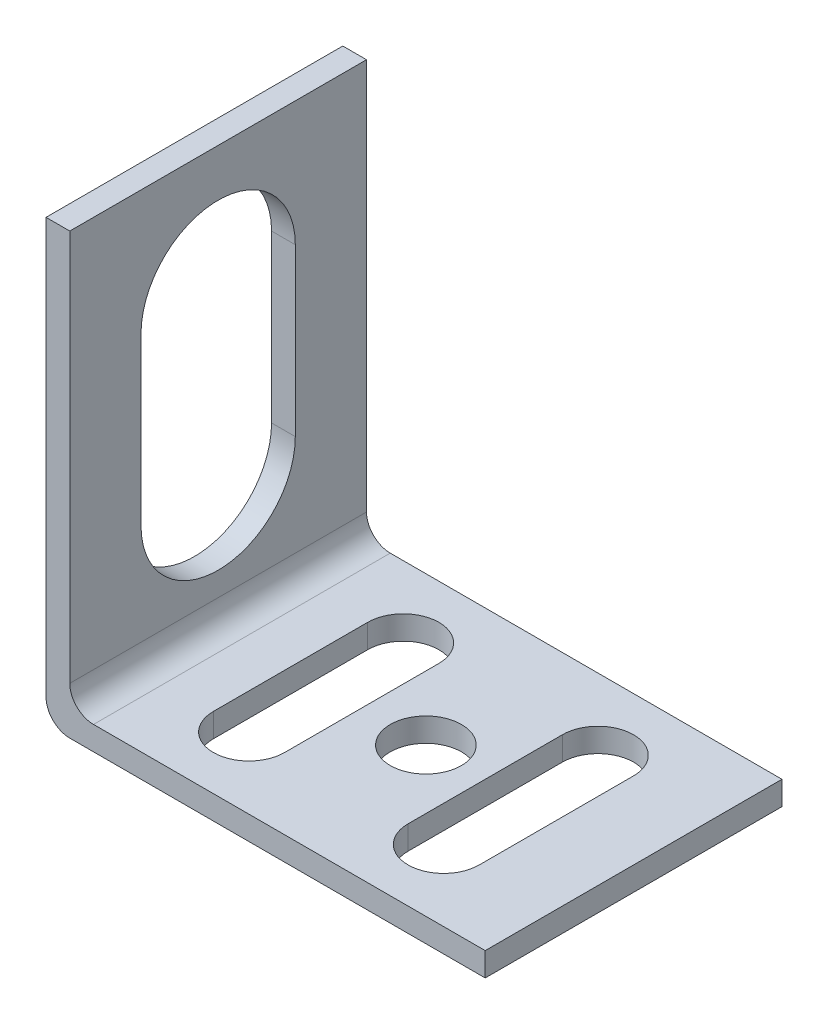
ISO-10303-21;
HEADER;
FILE_DESCRIPTION(('STEP AP214'),'2;1');
FILE_NAME('part.step','',(''),(''),'','','');
FILE_SCHEMA(('AUTOMOTIVE_DESIGN { 1 0 10303 214 1 1 1 1 }'));
ENDSEC;
DATA;
#1=APPLICATION_CONTEXT('core data for automotive mechanical design processes');
#2=APPLICATION_PROTOCOL_DEFINITION('international standard','automotive_design',2000,#1);
#3=PRODUCT_CONTEXT('',#1,'mechanical');
#4=PRODUCT('Part','Part','',(#3));
#5=PRODUCT_RELATED_PRODUCT_CATEGORY('part','',(#4));
#6=PRODUCT_DEFINITION_FORMATION('','',#4);
#7=PRODUCT_DEFINITION_CONTEXT('part definition',#1,'design');
#8=PRODUCT_DEFINITION('design','',#6,#7);
#9=PRODUCT_DEFINITION_SHAPE('','',#8);
#10=(LENGTH_UNIT() NAMED_UNIT(*) SI_UNIT(.MILLI.,.METRE.));
#11=(NAMED_UNIT(*) PLANE_ANGLE_UNIT() SI_UNIT($,.RADIAN.));
#12=(NAMED_UNIT(*) SI_UNIT($,.STERADIAN.) SOLID_ANGLE_UNIT());
#13=UNCERTAINTY_MEASURE_WITH_UNIT(LENGTH_MEASURE(1.E-05),#10,'distance_accuracy_value','');
#14=(GEOMETRIC_REPRESENTATION_CONTEXT(3) GLOBAL_UNCERTAINTY_ASSIGNED_CONTEXT((#13)) GLOBAL_UNIT_ASSIGNED_CONTEXT((#10,
#11,#12)) REPRESENTATION_CONTEXT('',''));
#15=CARTESIAN_POINT('',(0.,0.,0.));
#16=DIRECTION('',(0.,0.,1.));
#17=DIRECTION('',(1.,0.,0.));
#18=AXIS2_PLACEMENT_3D('',#15,#16,#17);
#19=CARTESIAN_POINT('',(-19.0993391080665,23.459186619342,25.));
#20=DIRECTION('',(0.,-1.,0.));
#21=DIRECTION('',(0.,0.,-1.));
#22=AXIS2_PLACEMENT_3D('',#19,#20,#21);
#23=PLANE('',#22);
#24=DIRECTION('',(-1.,0.,0.));
#25=VECTOR('',#24,1.);
#26=CARTESIAN_POINT('',(-19.0993391080665,23.459186619342,0.));
#27=LINE('',#26,#25);
#28=CARTESIAN_POINT('',(-17.0993391080665,23.459186619342,0.));
#29=VERTEX_POINT('',#28);
#30=CARTESIAN_POINT('',(-19.0993391080665,23.459186619342,0.));
#31=VERTEX_POINT('',#30);
#32=EDGE_CURVE('E237',#29,#31,#27,.T.);
#33=ORIENTED_EDGE('',*,*,#32,.T.);
#34=DIRECTION('',(0.,0.,-1.));
#35=VECTOR('',#34,1.);
#36=CARTESIAN_POINT('',(-19.0993391080665,23.459186619342,25.));
#37=LINE('',#36,#35);
#38=CARTESIAN_POINT('',(-19.0993391080665,23.459186619342,25.));
#39=VERTEX_POINT('',#38);
#40=EDGE_CURVE('E298',#39,#31,#37,.T.);
#41=ORIENTED_EDGE('',*,*,#40,.F.);
#42=DIRECTION('',(-1.,0.,0.));
#43=VECTOR('',#42,1.);
#44=CARTESIAN_POINT('',(-19.0993391080665,23.459186619342,25.));
#45=LINE('',#44,#43);
#46=CARTESIAN_POINT('',(-17.0993391080665,23.459186619342,25.));
#47=VERTEX_POINT('',#46);
#48=EDGE_CURVE('E244',#47,#39,#45,.T.);
#49=ORIENTED_EDGE('',*,*,#48,.F.);
#50=DIRECTION('',(0.,0.,-1.));
#51=VECTOR('',#50,1.);
#52=CARTESIAN_POINT('',(-17.0993391080665,23.459186619342,25.));
#53=LINE('',#52,#51);
#54=EDGE_CURVE('E262',#47,#29,#53,.T.);
#55=ORIENTED_EDGE('',*,*,#54,.T.);
#56=EDGE_LOOP('',(#33,#41,#49,#55));
#57=FACE_BOUND('',#56,.T.);
#58=ADVANCED_FACE('F37',(#57),#23,.F.);
#59=CARTESIAN_POINT('',(-19.0993391080665,23.459186619342,25.));
#60=DIRECTION('',(1.,0.,0.));
#61=DIRECTION('',(0.,0.,-1.));
#62=AXIS2_PLACEMENT_3D('',#59,#60,#61);
#63=PLANE('',#62);
#64=CARTESIAN_POINT('',(-19.0993391080665,12.9591866193421,12.5));
#65=DIRECTION('',(-1.,0.,0.));
#66=DIRECTION('',(0.,0.,1.));
#67=AXIS2_PLACEMENT_3D('',#64,#65,#66);
#68=CIRCLE('',#67,6.5);
#69=CARTESIAN_POINT('',(-19.0993391080665,12.9591866193421,19.));
#70=VERTEX_POINT('',#69);
#71=CARTESIAN_POINT('',(-19.0993391080665,12.9591866193421,6.));
#72=VERTEX_POINT('',#71);
#73=EDGE_CURVE('E225',#70,#72,#68,.T.);
#74=ORIENTED_EDGE('',*,*,#73,.F.);
#75=DIRECTION('',(0.,1.,0.));
#76=VECTOR('',#75,1.);
#77=CARTESIAN_POINT('',(-19.0993391080665,0.,19.));
#78=LINE('',#77,#76);
#79=CARTESIAN_POINT('',(-19.0993391080665,-1.04081338065794,19.));
#80=VERTEX_POINT('',#79);
#81=EDGE_CURVE('E223',#80,#70,#78,.T.);
#82=ORIENTED_EDGE('',*,*,#81,.F.);
#83=CARTESIAN_POINT('',(-19.0993391080665,-1.04081338065794,12.5));
#84=DIRECTION('',(-1.,0.,0.));
#85=DIRECTION('',(0.,0.,1.));
#86=AXIS2_PLACEMENT_3D('',#83,#84,#85);
#87=CIRCLE('',#86,6.5);
#88=CARTESIAN_POINT('',(-19.0993391080665,-1.04081338065794,6.));
#89=VERTEX_POINT('',#88);
#90=EDGE_CURVE('E231',#89,#80,#87,.T.);
#91=ORIENTED_EDGE('',*,*,#90,.F.);
#92=DIRECTION('',(0.,1.,0.));
#93=VECTOR('',#92,1.);
#94=CARTESIAN_POINT('',(-19.0993391080665,0.,6.));
#95=LINE('',#94,#93);
#96=EDGE_CURVE('E228',#89,#72,#95,.T.);
#97=ORIENTED_EDGE('',*,*,#96,.T.);
#98=EDGE_LOOP('',(#74,#82,#91,#97));
#99=FACE_BOUND('',#98,.T.);
#100=DIRECTION('',(0.,-1.,0.));
#101=VECTOR('',#100,1.);
#102=CARTESIAN_POINT('',(-19.0993391080665,23.459186619342,0.));
#103=LINE('',#102,#101);
#104=CARTESIAN_POINT('',(-19.0993391080665,-11.5408133806579,0.));
#105=VERTEX_POINT('',#104);
#106=EDGE_CURVE('E265',#31,#105,#103,.T.);
#107=ORIENTED_EDGE('',*,*,#106,.T.);
#108=DIRECTION('',(0.,0.,-1.));
#109=VECTOR('',#108,1.);
#110=CARTESIAN_POINT('',(-19.0993391080665,-11.5408133806579,25.));
#111=LINE('',#110,#109);
#112=CARTESIAN_POINT('',(-19.0993391080665,-11.5408133806579,25.));
#113=VERTEX_POINT('',#112);
#114=EDGE_CURVE('E295',#113,#105,#111,.T.);
#115=ORIENTED_EDGE('',*,*,#114,.F.);
#116=DIRECTION('',(0.,-1.,0.));
#117=VECTOR('',#116,1.);
#118=CARTESIAN_POINT('',(-19.0993391080665,23.459186619342,25.));
#119=LINE('',#118,#117);
#120=EDGE_CURVE('E247',#39,#113,#119,.T.);
#121=ORIENTED_EDGE('',*,*,#120,.F.);
#122=ORIENTED_EDGE('',*,*,#40,.T.);
#123=EDGE_LOOP('',(#107,#115,#121,#122));
#124=FACE_BOUND('',#123,.T.);
#125=ADVANCED_FACE('F361',(#99,#124),#63,.F.);
#126=CARTESIAN_POINT('',(-17.0993391080665,-11.5408133806579,25.));
#127=DIRECTION('',(0.,0.,-1.));
#128=DIRECTION('',(-1.,0.,0.));
#129=AXIS2_PLACEMENT_3D('',#126,#127,#128);
#130=CYLINDRICAL_SURFACE('',#129,2.);
#131=CARTESIAN_POINT('',(-17.0993391080665,-11.5408133806579,0.));
#132=DIRECTION('',(0.,0.,1.));
#133=DIRECTION('',(-1.,0.,0.));
#134=AXIS2_PLACEMENT_3D('',#131,#132,#133);
#135=CIRCLE('',#134,2.);
#136=CARTESIAN_POINT('',(-17.0993391080665,-13.5408133806579,0.));
#137=VERTEX_POINT('',#136);
#138=EDGE_CURVE('E267',#105,#137,#135,.T.);
#139=ORIENTED_EDGE('',*,*,#138,.T.);
#140=DIRECTION('',(0.,0.,-1.));
#141=VECTOR('',#140,1.);
#142=CARTESIAN_POINT('',(-17.0993391080665,-13.5408133806579,25.));
#143=LINE('',#142,#141);
#144=CARTESIAN_POINT('',(-17.0993391080665,-13.5408133806579,25.));
#145=VERTEX_POINT('',#144);
#146=EDGE_CURVE('E292',#145,#137,#143,.T.);
#147=ORIENTED_EDGE('',*,*,#146,.F.);
#148=CARTESIAN_POINT('',(-17.0993391080665,-11.5408133806579,25.));
#149=DIRECTION('',(0.,0.,1.));
#150=DIRECTION('',(-1.,0.,0.));
#151=AXIS2_PLACEMENT_3D('',#148,#149,#150);
#152=CIRCLE('',#151,2.);
#153=EDGE_CURVE('E250',#113,#145,#152,.T.);
#154=ORIENTED_EDGE('',*,*,#153,.F.);
#155=ORIENTED_EDGE('',*,*,#114,.T.);
#156=EDGE_LOOP('',(#139,#147,#154,#155));
#157=FACE_BOUND('',#156,.T.);
#158=ADVANCED_FACE('F366',(#157),#130,.T.);
#159=CARTESIAN_POINT('',(-17.0993391080665,-13.5408133806579,25.));
#160=DIRECTION('',(0.,1.,0.));
#161=DIRECTION('',(0.,0.,1.));
#162=AXIS2_PLACEMENT_3D('',#159,#160,#161);
#163=PLANE('',#162);
#164=DIRECTION('',(0.,0.,1.));
#165=VECTOR('',#164,1.);
#166=CARTESIAN_POINT('',(-5.00204565377172,-13.5408133806579,6.));
#167=LINE('',#166,#165);
#168=CARTESIAN_POINT('',(-5.00204565377172,-13.5408133806579,6.));
#169=VERTEX_POINT('',#168);
#170=CARTESIAN_POINT('',(-5.00204565377172,-13.5408133806579,19.));
#171=VERTEX_POINT('',#170);
#172=EDGE_CURVE('E219',#169,#171,#167,.T.);
#173=ORIENTED_EDGE('',*,*,#172,.F.);
#174=CARTESIAN_POINT('',(-8.00204565377172,-13.5408133806579,6.));
#175=DIRECTION('',(0.,-1.,0.));
#176=DIRECTION('',(0.,0.,-1.));
#177=AXIS2_PLACEMENT_3D('',#174,#175,#176);
#178=CIRCLE('',#177,3.);
#179=CARTESIAN_POINT('',(-11.0020456537717,-13.5408133806579,6.));
#180=VERTEX_POINT('',#179);
#181=EDGE_CURVE('E51',#180,#169,#178,.T.);
#182=ORIENTED_EDGE('',*,*,#181,.F.);
#183=DIRECTION('',(0.,0.,-1.));
#184=VECTOR('',#183,1.);
#185=CARTESIAN_POINT('',(-11.0020456537717,-13.5408133806579,6.));
#186=LINE('',#185,#184);
#187=CARTESIAN_POINT('',(-11.0020456537717,-13.5408133806579,19.));
#188=VERTEX_POINT('',#187);
#189=EDGE_CURVE('E207',#188,#180,#186,.T.);
#190=ORIENTED_EDGE('',*,*,#189,.F.);
#191=CARTESIAN_POINT('',(-8.00204565377172,-13.5408133806579,19.));
#192=DIRECTION('',(0.,-1.,0.));
#193=DIRECTION('',(0.,0.,-1.));
#194=AXIS2_PLACEMENT_3D('',#191,#192,#193);
#195=CIRCLE('',#194,3.);
#196=EDGE_CURVE('E216',#171,#188,#195,.T.);
#197=ORIENTED_EDGE('',*,*,#196,.F.);
#198=EDGE_LOOP('',(#173,#182,#190,#197));
#199=FACE_BOUND('',#198,.T.);
#200=DIRECTION('',(0.,0.,1.));
#201=VECTOR('',#200,1.);
#202=CARTESIAN_POINT('',(11.4006608919335,-13.5408133806579,6.));
#203=LINE('',#202,#201);
#204=CARTESIAN_POINT('',(11.4006608919335,-13.5408133806579,6.));
#205=VERTEX_POINT('',#204);
#206=CARTESIAN_POINT('',(11.4006608919335,-13.5408133806579,19.));
#207=VERTEX_POINT('',#206);
#208=EDGE_CURVE('E196',#205,#207,#203,.T.);
#209=ORIENTED_EDGE('',*,*,#208,.F.);
#210=CARTESIAN_POINT('',(8.40066089193349,-13.5408133806579,6.));
#211=DIRECTION('',(0.,-1.,0.));
#212=DIRECTION('',(0.,0.,-1.));
#213=AXIS2_PLACEMENT_3D('',#210,#211,#212);
#214=CIRCLE('',#213,3.);
#215=CARTESIAN_POINT('',(5.40066089193349,-13.5408133806579,6.));
#216=VERTEX_POINT('',#215);
#217=EDGE_CURVE('E59',#216,#205,#214,.T.);
#218=ORIENTED_EDGE('',*,*,#217,.F.);
#219=DIRECTION('',(0.,0.,-1.));
#220=VECTOR('',#219,1.);
#221=CARTESIAN_POINT('',(5.40066089193349,-13.5408133806579,6.));
#222=LINE('',#221,#220);
#223=CARTESIAN_POINT('',(5.40066089193348,-13.5408133806579,19.));
#224=VERTEX_POINT('',#223);
#225=EDGE_CURVE('E183',#224,#216,#222,.T.);
#226=ORIENTED_EDGE('',*,*,#225,.F.);
#227=CARTESIAN_POINT('',(8.40066089193348,-13.5408133806579,19.));
#228=DIRECTION('',(0.,-1.,0.));
#229=DIRECTION('',(0.,0.,-1.));
#230=AXIS2_PLACEMENT_3D('',#227,#228,#229);
#231=CIRCLE('',#230,3.);
#232=EDGE_CURVE('E189',#207,#224,#231,.T.);
#233=ORIENTED_EDGE('',*,*,#232,.F.);
#234=EDGE_LOOP('',(#209,#218,#226,#233));
#235=FACE_BOUND('',#234,.T.);
#236=CARTESIAN_POINT('',(0.400660891933486,-13.5408133806579,12.5));
#237=DIRECTION('',(0.,-1.,0.));
#238=DIRECTION('',(0.,0.,-1.));
#239=AXIS2_PLACEMENT_3D('',#236,#237,#238);
#240=CIRCLE('',#239,3.);
#241=CARTESIAN_POINT('',(0.400660891933486,-13.5408133806579,9.5));
#242=VERTEX_POINT('',#241);
#243=EDGE_CURVE('E197',#242,#242,#240,.T.);
#244=ORIENTED_EDGE('',*,*,#243,.F.);
#245=EDGE_LOOP('',(#244));
#246=FACE_BOUND('',#245,.T.);
#247=DIRECTION('',(1.,0.,0.));
#248=VECTOR('',#247,1.);
#249=CARTESIAN_POINT('',(-17.0993391080665,-13.5408133806579,0.));
#250=LINE('',#249,#248);
#251=CARTESIAN_POINT('',(17.9006608919335,-13.5408133806579,0.));
#252=VERTEX_POINT('',#251);
#253=EDGE_CURVE('E269',#137,#252,#250,.T.);
#254=ORIENTED_EDGE('',*,*,#253,.T.);
#255=DIRECTION('',(0.,0.,-1.));
#256=VECTOR('',#255,1.);
#257=CARTESIAN_POINT('',(17.9006608919335,-13.5408133806579,25.));
#258=LINE('',#257,#256);
#259=CARTESIAN_POINT('',(17.9006608919335,-13.5408133806579,25.));
#260=VERTEX_POINT('',#259);
#261=EDGE_CURVE('E289',#260,#252,#258,.T.);
#262=ORIENTED_EDGE('',*,*,#261,.F.);
#263=DIRECTION('',(1.,0.,0.));
#264=VECTOR('',#263,1.);
#265=CARTESIAN_POINT('',(-17.0993391080665,-13.5408133806579,25.));
#266=LINE('',#265,#264);
#267=EDGE_CURVE('E252',#145,#260,#266,.T.);
#268=ORIENTED_EDGE('',*,*,#267,.F.);
#269=ORIENTED_EDGE('',*,*,#146,.T.);
#270=EDGE_LOOP('',(#254,#262,#268,#269));
#271=FACE_BOUND('',#270,.T.);
#272=ADVANCED_FACE('F193',(#199,#235,#246,#271),#163,.F.);
#273=CARTESIAN_POINT('',(17.9006608919335,-11.5408133806579,25.));
#274=DIRECTION('',(-1.,0.,0.));
#275=DIRECTION('',(0.,0.,1.));
#276=AXIS2_PLACEMENT_3D('',#273,#274,#275);
#277=PLANE('',#276);
#278=DIRECTION('',(0.,1.,0.));
#279=VECTOR('',#278,1.);
#280=CARTESIAN_POINT('',(17.9006608919335,-11.5408133806579,0.));
#281=LINE('',#280,#279);
#282=CARTESIAN_POINT('',(17.9006608919335,-11.5408133806579,0.));
#283=VERTEX_POINT('',#282);
#284=EDGE_CURVE('E271',#252,#283,#281,.T.);
#285=ORIENTED_EDGE('',*,*,#284,.T.);
#286=DIRECTION('',(0.,0.,-1.));
#287=VECTOR('',#286,1.);
#288=CARTESIAN_POINT('',(17.9006608919335,-11.5408133806579,25.));
#289=LINE('',#288,#287);
#290=CARTESIAN_POINT('',(17.9006608919335,-11.5408133806579,25.));
#291=VERTEX_POINT('',#290);
#292=EDGE_CURVE('E286',#291,#283,#289,.T.);
#293=ORIENTED_EDGE('',*,*,#292,.F.);
#294=DIRECTION('',(0.,1.,0.));
#295=VECTOR('',#294,1.);
#296=CARTESIAN_POINT('',(17.9006608919335,-11.5408133806579,25.));
#297=LINE('',#296,#295);
#298=EDGE_CURVE('E254',#260,#291,#297,.T.);
#299=ORIENTED_EDGE('',*,*,#298,.F.);
#300=ORIENTED_EDGE('',*,*,#261,.T.);
#301=EDGE_LOOP('',(#285,#293,#299,#300));
#302=FACE_BOUND('',#301,.T.);
#303=ADVANCED_FACE('F398',(#302),#277,.F.);
#304=CARTESIAN_POINT('',(-15.0993391080665,-11.5408133806579,25.));
#305=DIRECTION('',(0.,-1.,0.));
#306=DIRECTION('',(0.,0.,-1.));
#307=AXIS2_PLACEMENT_3D('',#304,#305,#306);
#308=PLANE('',#307);
#309=DIRECTION('',(0.,0.,-1.));
#310=VECTOR('',#309,1.);
#311=CARTESIAN_POINT('',(-11.0020456537717,-11.5408133806579,25.));
#312=LINE('',#311,#310);
#313=CARTESIAN_POINT('',(-11.0020456537717,-11.5408133806579,19.));
#314=VERTEX_POINT('',#313);
#315=CARTESIAN_POINT('',(-11.0020456537717,-11.5408133806579,6.));
#316=VERTEX_POINT('',#315);
#317=EDGE_CURVE('E44',#314,#316,#312,.T.);
#318=ORIENTED_EDGE('',*,*,#317,.T.);
#319=CARTESIAN_POINT('',(-8.00204565377172,-11.5408133806579,6.));
#320=DIRECTION('',(0.,-1.,0.));
#321=DIRECTION('',(0.,0.,-1.));
#322=AXIS2_PLACEMENT_3D('',#319,#320,#321);
#323=CIRCLE('',#322,3.);
#324=CARTESIAN_POINT('',(-5.00204565377172,-11.5408133806579,6.));
#325=VERTEX_POINT('',#324);
#326=EDGE_CURVE('E11',#316,#325,#323,.T.);
#327=ORIENTED_EDGE('',*,*,#326,.T.);
#328=DIRECTION('',(0.,0.,1.));
#329=VECTOR('',#328,1.);
#330=CARTESIAN_POINT('',(-5.00204565377172,-11.5408133806579,25.));
#331=LINE('',#330,#329);
#332=CARTESIAN_POINT('',(-5.00204565377172,-11.5408133806579,19.));
#333=VERTEX_POINT('',#332);
#334=EDGE_CURVE('E324',#325,#333,#331,.T.);
#335=ORIENTED_EDGE('',*,*,#334,.T.);
#336=CARTESIAN_POINT('',(-8.00204565377172,-11.5408133806579,19.));
#337=DIRECTION('',(0.,-1.,0.));
#338=DIRECTION('',(0.,0.,-1.));
#339=AXIS2_PLACEMENT_3D('',#336,#337,#338);
#340=CIRCLE('',#339,3.);
#341=EDGE_CURVE('E327',#333,#314,#340,.T.);
#342=ORIENTED_EDGE('',*,*,#341,.T.);
#343=EDGE_LOOP('',(#318,#327,#335,#342));
#344=FACE_BOUND('',#343,.T.);
#345=DIRECTION('',(0.,0.,-1.));
#346=VECTOR('',#345,1.);
#347=CARTESIAN_POINT('',(5.40066089193349,-11.5408133806579,25.));
#348=LINE('',#347,#346);
#349=CARTESIAN_POINT('',(5.40066089193348,-11.5408133806579,19.));
#350=VERTEX_POINT('',#349);
#351=CARTESIAN_POINT('',(5.40066089193349,-11.5408133806579,6.));
#352=VERTEX_POINT('',#351);
#353=EDGE_CURVE('E321',#350,#352,#348,.T.);
#354=ORIENTED_EDGE('',*,*,#353,.T.);
#355=CARTESIAN_POINT('',(8.40066089193349,-11.5408133806579,6.));
#356=DIRECTION('',(0.,-1.,0.));
#357=DIRECTION('',(0.,0.,-1.));
#358=AXIS2_PLACEMENT_3D('',#355,#356,#357);
#359=CIRCLE('',#358,3.);
#360=CARTESIAN_POINT('',(11.4006608919335,-11.5408133806579,6.));
#361=VERTEX_POINT('',#360);
#362=EDGE_CURVE('E177',#352,#361,#359,.T.);
#363=ORIENTED_EDGE('',*,*,#362,.T.);
#364=DIRECTION('',(0.,0.,1.));
#365=VECTOR('',#364,1.);
#366=CARTESIAN_POINT('',(11.4006608919335,-11.5408133806579,25.));
#367=LINE('',#366,#365);
#368=CARTESIAN_POINT('',(11.4006608919335,-11.5408133806579,19.));
#369=VERTEX_POINT('',#368);
#370=EDGE_CURVE('E313',#361,#369,#367,.T.);
#371=ORIENTED_EDGE('',*,*,#370,.T.);
#372=CARTESIAN_POINT('',(8.40066089193348,-11.5408133806579,19.));
#373=DIRECTION('',(0.,-1.,0.));
#374=DIRECTION('',(0.,0.,-1.));
#375=AXIS2_PLACEMENT_3D('',#372,#373,#374);
#376=CIRCLE('',#375,3.);
#377=EDGE_CURVE('E318',#369,#350,#376,.T.);
#378=ORIENTED_EDGE('',*,*,#377,.T.);
#379=EDGE_LOOP('',(#354,#363,#371,#378));
#380=FACE_BOUND('',#379,.T.);
#381=CARTESIAN_POINT('',(0.400660891933486,-11.5408133806579,12.5));
#382=DIRECTION('',(0.,-1.,0.));
#383=DIRECTION('',(0.,0.,-1.));
#384=AXIS2_PLACEMENT_3D('',#381,#382,#383);
#385=CIRCLE('',#384,3.);
#386=CARTESIAN_POINT('',(0.400660891933486,-11.5408133806579,9.5));
#387=VERTEX_POINT('',#386);
#388=EDGE_CURVE('E200',#387,#387,#385,.T.);
#389=ORIENTED_EDGE('',*,*,#388,.T.);
#390=EDGE_LOOP('',(#389));
#391=FACE_BOUND('',#390,.T.);
#392=DIRECTION('',(-1.,0.,0.));
#393=VECTOR('',#392,1.);
#394=CARTESIAN_POINT('',(-15.0993391080665,-11.5408133806579,0.));
#395=LINE('',#394,#393);
#396=CARTESIAN_POINT('',(-15.0993391080665,-11.5408133806579,0.));
#397=VERTEX_POINT('',#396);
#398=EDGE_CURVE('E273',#283,#397,#395,.T.);
#399=ORIENTED_EDGE('',*,*,#398,.T.);
#400=DIRECTION('',(0.,0.,-1.));
#401=VECTOR('',#400,1.);
#402=CARTESIAN_POINT('',(-15.0993391080665,-11.5408133806579,25.));
#403=LINE('',#402,#401);
#404=CARTESIAN_POINT('',(-15.0993391080665,-11.5408133806579,25.));
#405=VERTEX_POINT('',#404);
#406=EDGE_CURVE('E283',#405,#397,#403,.T.);
#407=ORIENTED_EDGE('',*,*,#406,.F.);
#408=DIRECTION('',(-1.,0.,0.));
#409=VECTOR('',#408,1.);
#410=CARTESIAN_POINT('',(-15.0993391080665,-11.5408133806579,25.));
#411=LINE('',#410,#409);
#412=EDGE_CURVE('E256',#291,#405,#411,.T.);
#413=ORIENTED_EDGE('',*,*,#412,.F.);
#414=ORIENTED_EDGE('',*,*,#292,.T.);
#415=EDGE_LOOP('',(#399,#407,#413,#414));
#416=FACE_BOUND('',#415,.T.);
#417=ADVANCED_FACE('F331',(#344,#380,#391,#416),#308,.F.);
#418=CARTESIAN_POINT('',(-15.0993391080665,-9.54081338065795,25.));
#419=DIRECTION('',(0.,0.,-1.));
#420=DIRECTION('',(-1.,0.,0.));
#421=AXIS2_PLACEMENT_3D('',#418,#419,#420);
#422=CYLINDRICAL_SURFACE('',#421,2.);
#423=CARTESIAN_POINT('',(-15.0993391080665,-9.54081338065795,0.));
#424=DIRECTION('',(0.,0.,-1.));
#425=DIRECTION('',(-1.,0.,0.));
#426=AXIS2_PLACEMENT_3D('',#423,#424,#425);
#427=CIRCLE('',#426,2.);
#428=CARTESIAN_POINT('',(-17.0993391080665,-9.54081338065795,0.));
#429=VERTEX_POINT('',#428);
#430=EDGE_CURVE('E275',#397,#429,#427,.T.);
#431=ORIENTED_EDGE('',*,*,#430,.T.);
#432=DIRECTION('',(0.,0.,-1.));
#433=VECTOR('',#432,1.);
#434=CARTESIAN_POINT('',(-17.0993391080665,-9.54081338065795,25.));
#435=LINE('',#434,#433);
#436=CARTESIAN_POINT('',(-17.0993391080665,-9.54081338065795,25.));
#437=VERTEX_POINT('',#436);
#438=EDGE_CURVE('E280',#437,#429,#435,.T.);
#439=ORIENTED_EDGE('',*,*,#438,.F.);
#440=CARTESIAN_POINT('',(-15.0993391080665,-9.54081338065795,25.));
#441=DIRECTION('',(0.,0.,-1.));
#442=DIRECTION('',(-1.,0.,0.));
#443=AXIS2_PLACEMENT_3D('',#440,#441,#442);
#444=CIRCLE('',#443,2.);
#445=EDGE_CURVE('E258',#405,#437,#444,.T.);
#446=ORIENTED_EDGE('',*,*,#445,.F.);
#447=ORIENTED_EDGE('',*,*,#406,.T.);
#448=EDGE_LOOP('',(#431,#439,#446,#447));
#449=FACE_BOUND('',#448,.T.);
#450=ADVANCED_FACE('F389',(#449),#422,.F.);
#451=CARTESIAN_POINT('',(-17.0993391080665,23.459186619342,25.));
#452=DIRECTION('',(-1.,0.,0.));
#453=DIRECTION('',(0.,0.,1.));
#454=AXIS2_PLACEMENT_3D('',#451,#452,#453);
#455=PLANE('',#454);
#456=CARTESIAN_POINT('',(-17.0993391080665,-1.04081338065794,12.5));
#457=DIRECTION('',(-1.,0.,0.));
#458=DIRECTION('',(0.,0.,1.));
#459=AXIS2_PLACEMENT_3D('',#456,#457,#458);
#460=CIRCLE('',#459,6.5);
#461=CARTESIAN_POINT('',(-17.0993391080665,-1.04081338065794,6.));
#462=VERTEX_POINT('',#461);
#463=CARTESIAN_POINT('',(-17.0993391080665,-1.04081338065794,19.));
#464=VERTEX_POINT('',#463);
#465=EDGE_CURVE('E307',#462,#464,#460,.T.);
#466=ORIENTED_EDGE('',*,*,#465,.T.);
#467=DIRECTION('',(0.,1.,0.));
#468=VECTOR('',#467,1.);
#469=CARTESIAN_POINT('',(-17.0993391080665,23.459186619342,19.));
#470=LINE('',#469,#468);
#471=CARTESIAN_POINT('',(-17.0993391080665,12.9591866193421,19.));
#472=VERTEX_POINT('',#471);
#473=EDGE_CURVE('E310',#464,#472,#470,.T.);
#474=ORIENTED_EDGE('',*,*,#473,.T.);
#475=CARTESIAN_POINT('',(-17.0993391080665,12.9591866193421,12.5));
#476=DIRECTION('',(-1.,0.,0.));
#477=DIRECTION('',(0.,0.,1.));
#478=AXIS2_PLACEMENT_3D('',#475,#476,#477);
#479=CIRCLE('',#478,6.5);
#480=CARTESIAN_POINT('',(-17.0993391080665,12.9591866193421,6.));
#481=VERTEX_POINT('',#480);
#482=EDGE_CURVE('E301',#472,#481,#479,.T.);
#483=ORIENTED_EDGE('',*,*,#482,.T.);
#484=DIRECTION('',(0.,1.,0.));
#485=VECTOR('',#484,1.);
#486=CARTESIAN_POINT('',(-17.0993391080665,23.459186619342,6.));
#487=LINE('',#486,#485);
#488=EDGE_CURVE('E304',#462,#481,#487,.T.);
#489=ORIENTED_EDGE('',*,*,#488,.F.);
#490=EDGE_LOOP('',(#466,#474,#483,#489));
#491=FACE_BOUND('',#490,.T.);
#492=DIRECTION('',(0.,1.,0.));
#493=VECTOR('',#492,1.);
#494=CARTESIAN_POINT('',(-17.0993391080665,23.459186619342,0.));
#495=LINE('',#494,#493);
#496=EDGE_CURVE('E248',#429,#29,#495,.T.);
#497=ORIENTED_EDGE('',*,*,#496,.T.);
#498=ORIENTED_EDGE('',*,*,#54,.F.);
#499=DIRECTION('',(0.,1.,0.));
#500=VECTOR('',#499,1.);
#501=CARTESIAN_POINT('',(-17.0993391080665,23.459186619342,25.));
#502=LINE('',#501,#500);
#503=EDGE_CURVE('E260',#437,#47,#502,.T.);
#504=ORIENTED_EDGE('',*,*,#503,.F.);
#505=ORIENTED_EDGE('',*,*,#438,.T.);
#506=EDGE_LOOP('',(#497,#498,#504,#505));
#507=FACE_BOUND('',#506,.T.);
#508=ADVANCED_FACE('F387',(#491,#507),#455,.F.);
#509=CARTESIAN_POINT('',(-15.0993391080665,-9.54081338065795,25.));
#510=DIRECTION('',(0.,0.,-1.));
#511=DIRECTION('',(-1.,0.,0.));
#512=AXIS2_PLACEMENT_3D('',#509,#510,#511);
#513=PLANE('',#512);
#514=ORIENTED_EDGE('',*,*,#48,.T.);
#515=ORIENTED_EDGE('',*,*,#120,.T.);
#516=ORIENTED_EDGE('',*,*,#153,.T.);
#517=ORIENTED_EDGE('',*,*,#267,.T.);
#518=ORIENTED_EDGE('',*,*,#298,.T.);
#519=ORIENTED_EDGE('',*,*,#412,.T.);
#520=ORIENTED_EDGE('',*,*,#445,.T.);
#521=ORIENTED_EDGE('',*,*,#503,.T.);
#522=EDGE_LOOP('',(#514,#515,#516,#517,#518,#519,#520,#521));
#523=FACE_BOUND('',#522,.T.);
#524=ADVANCED_FACE('F382',(#523),#513,.F.);
#525=CARTESIAN_POINT('',(-15.0993391080665,-9.54081338065795,0.));
#526=DIRECTION('',(0.,0.,-1.));
#527=DIRECTION('',(-1.,0.,0.));
#528=AXIS2_PLACEMENT_3D('',#525,#526,#527);
#529=PLANE('',#528);
#530=ORIENTED_EDGE('',*,*,#32,.F.);
#531=ORIENTED_EDGE('',*,*,#496,.F.);
#532=ORIENTED_EDGE('',*,*,#430,.F.);
#533=ORIENTED_EDGE('',*,*,#398,.F.);
#534=ORIENTED_EDGE('',*,*,#284,.F.);
#535=ORIENTED_EDGE('',*,*,#253,.F.);
#536=ORIENTED_EDGE('',*,*,#138,.F.);
#537=ORIENTED_EDGE('',*,*,#106,.F.);
#538=EDGE_LOOP('',(#530,#531,#532,#533,#534,#535,#536,#537));
#539=FACE_BOUND('',#538,.T.);
#540=ADVANCED_FACE('F374',(#539),#529,.T.);
#541=CARTESIAN_POINT('',(5.90066089193348,0.,19.));
#542=DIRECTION('',(0.,0.,1.));
#543=DIRECTION('',(0.,-1.,0.));
#544=AXIS2_PLACEMENT_3D('',#541,#542,#543);
#545=PLANE('',#544);
#546=DIRECTION('',(-1.,0.,0.));
#547=VECTOR('',#546,1.);
#548=CARTESIAN_POINT('',(5.90066089193348,-1.04081338065794,19.));
#549=LINE('',#548,#547);
#550=EDGE_CURVE('E235',#464,#80,#549,.T.);
#551=ORIENTED_EDGE('',*,*,#550,.T.);
#552=ORIENTED_EDGE('',*,*,#81,.T.);
#553=DIRECTION('',(-1.,0.,0.));
#554=VECTOR('',#553,1.);
#555=CARTESIAN_POINT('',(5.90066089193348,12.9591866193421,19.));
#556=LINE('',#555,#554);
#557=EDGE_CURVE('E234',#472,#70,#556,.T.);
#558=ORIENTED_EDGE('',*,*,#557,.F.);
#559=ORIENTED_EDGE('',*,*,#473,.F.);
#560=EDGE_LOOP('',(#551,#552,#558,#559));
#561=FACE_BOUND('',#560,.T.);
#562=ADVANCED_FACE('F422',(#561),#545,.F.);
#563=CARTESIAN_POINT('',(5.90066089193348,-1.04081338065794,12.5));
#564=DIRECTION('',(-1.,0.,0.));
#565=DIRECTION('',(0.,0.,1.));
#566=AXIS2_PLACEMENT_3D('',#563,#564,#565);
#567=CYLINDRICAL_SURFACE('',#566,6.5);
#568=DIRECTION('',(-1.,0.,0.));
#569=VECTOR('',#568,1.);
#570=CARTESIAN_POINT('',(5.90066089193348,-1.04081338065794,6.));
#571=LINE('',#570,#569);
#572=EDGE_CURVE('E238',#462,#89,#571,.T.);
#573=ORIENTED_EDGE('',*,*,#572,.T.);
#574=ORIENTED_EDGE('',*,*,#90,.T.);
#575=ORIENTED_EDGE('',*,*,#550,.F.);
#576=ORIENTED_EDGE('',*,*,#465,.F.);
#577=EDGE_LOOP('',(#573,#574,#575,#576));
#578=FACE_BOUND('',#577,.T.);
#579=ADVANCED_FACE('F427',(#578),#567,.F.);
#580=CARTESIAN_POINT('',(5.90066089193348,0.,6.));
#581=DIRECTION('',(0.,0.,1.));
#582=DIRECTION('',(0.,-1.,0.));
#583=AXIS2_PLACEMENT_3D('',#580,#581,#582);
#584=PLANE('',#583);
#585=ORIENTED_EDGE('',*,*,#488,.T.);
#586=DIRECTION('',(-1.,0.,0.));
#587=VECTOR('',#586,1.);
#588=CARTESIAN_POINT('',(5.90066089193348,12.9591866193421,6.));
#589=LINE('',#588,#587);
#590=EDGE_CURVE('E240',#481,#72,#589,.T.);
#591=ORIENTED_EDGE('',*,*,#590,.T.);
#592=ORIENTED_EDGE('',*,*,#96,.F.);
#593=ORIENTED_EDGE('',*,*,#572,.F.);
#594=EDGE_LOOP('',(#585,#591,#592,#593));
#595=FACE_BOUND('',#594,.T.);
#596=ADVANCED_FACE('F433',(#595),#584,.T.);
#597=CARTESIAN_POINT('',(5.90066089193348,12.9591866193421,12.5));
#598=DIRECTION('',(-1.,0.,0.));
#599=DIRECTION('',(0.,0.,1.));
#600=AXIS2_PLACEMENT_3D('',#597,#598,#599);
#601=CYLINDRICAL_SURFACE('',#600,6.5);
#602=ORIENTED_EDGE('',*,*,#557,.T.);
#603=ORIENTED_EDGE('',*,*,#73,.T.);
#604=ORIENTED_EDGE('',*,*,#590,.F.);
#605=ORIENTED_EDGE('',*,*,#482,.F.);
#606=EDGE_LOOP('',(#602,#603,#604,#605));
#607=FACE_BOUND('',#606,.T.);
#608=ADVANCED_FACE('F429',(#607),#601,.F.);
#609=CARTESIAN_POINT('',(0.400660891933486,11.4591866193421,12.5));
#610=DIRECTION('',(0.,-1.,0.));
#611=DIRECTION('',(0.,0.,-1.));
#612=AXIS2_PLACEMENT_3D('',#609,#610,#611);
#613=CYLINDRICAL_SURFACE('',#612,3.);
#614=ORIENTED_EDGE('',*,*,#243,.T.);
#615=EDGE_LOOP('',(#614));
#616=FACE_BOUND('',#615,.T.);
#617=ORIENTED_EDGE('',*,*,#388,.F.);
#618=EDGE_LOOP('',(#617));
#619=FACE_BOUND('',#618,.T.);
#620=ADVANCED_FACE('F432',(#616,#619),#613,.F.);
#621=CARTESIAN_POINT('',(8.40066089193349,11.4591866193421,6.));
#622=DIRECTION('',(0.,-1.,0.));
#623=DIRECTION('',(0.,0.,-1.));
#624=AXIS2_PLACEMENT_3D('',#621,#622,#623);
#625=CYLINDRICAL_SURFACE('',#624,3.);
#626=DIRECTION('',(0.,-1.,0.));
#627=VECTOR('',#626,1.);
#628=CARTESIAN_POINT('',(5.40066089193349,11.4591866193421,6.));
#629=LINE('',#628,#627);
#630=EDGE_CURVE('E173',#352,#216,#629,.T.);
#631=ORIENTED_EDGE('',*,*,#630,.T.);
#632=ORIENTED_EDGE('',*,*,#217,.T.);
#633=DIRECTION('',(0.,-1.,0.));
#634=VECTOR('',#633,1.);
#635=CARTESIAN_POINT('',(11.4006608919335,11.4591866193421,6.));
#636=LINE('',#635,#634);
#637=EDGE_CURVE('E190',#361,#205,#636,.T.);
#638=ORIENTED_EDGE('',*,*,#637,.F.);
#639=ORIENTED_EDGE('',*,*,#362,.F.);
#640=EDGE_LOOP('',(#631,#632,#638,#639));
#641=FACE_BOUND('',#640,.T.);
#642=ADVANCED_FACE('F175',(#641),#625,.F.);
#643=CARTESIAN_POINT('',(5.40066089193349,11.4591866193421,6.));
#644=DIRECTION('',(-1.,0.,0.));
#645=DIRECTION('',(0.,0.,1.));
#646=AXIS2_PLACEMENT_3D('',#643,#644,#645);
#647=PLANE('',#646);
#648=DIRECTION('',(0.,-1.,0.));
#649=VECTOR('',#648,1.);
#650=CARTESIAN_POINT('',(5.40066089193348,11.4591866193421,19.));
#651=LINE('',#650,#649);
#652=EDGE_CURVE('E180',#350,#224,#651,.T.);
#653=ORIENTED_EDGE('',*,*,#652,.T.);
#654=ORIENTED_EDGE('',*,*,#225,.T.);
#655=ORIENTED_EDGE('',*,*,#630,.F.);
#656=ORIENTED_EDGE('',*,*,#353,.F.);
#657=EDGE_LOOP('',(#653,#654,#655,#656));
#658=FACE_BOUND('',#657,.T.);
#659=ADVANCED_FACE('F184',(#658),#647,.F.);
#660=CARTESIAN_POINT('',(8.40066089193348,11.4591866193421,19.));
#661=DIRECTION('',(0.,-1.,0.));
#662=DIRECTION('',(0.,0.,-1.));
#663=AXIS2_PLACEMENT_3D('',#660,#661,#662);
#664=CYLINDRICAL_SURFACE('',#663,3.);
#665=DIRECTION('',(0.,-1.,0.));
#666=VECTOR('',#665,1.);
#667=CARTESIAN_POINT('',(11.4006608919335,11.4591866193421,19.));
#668=LINE('',#667,#666);
#669=EDGE_CURVE('E631',#369,#207,#668,.T.);
#670=ORIENTED_EDGE('',*,*,#669,.T.);
#671=ORIENTED_EDGE('',*,*,#232,.T.);
#672=ORIENTED_EDGE('',*,*,#652,.F.);
#673=ORIENTED_EDGE('',*,*,#377,.F.);
#674=EDGE_LOOP('',(#670,#671,#672,#673));
#675=FACE_BOUND('',#674,.T.);
#676=ADVANCED_FACE('F355',(#675),#664,.F.);
#677=CARTESIAN_POINT('',(11.4006608919335,11.4591866193421,6.));
#678=DIRECTION('',(1.,0.,0.));
#679=DIRECTION('',(0.,0.,-1.));
#680=AXIS2_PLACEMENT_3D('',#677,#678,#679);
#681=PLANE('',#680);
#682=ORIENTED_EDGE('',*,*,#637,.T.);
#683=ORIENTED_EDGE('',*,*,#208,.T.);
#684=ORIENTED_EDGE('',*,*,#669,.F.);
#685=ORIENTED_EDGE('',*,*,#370,.F.);
#686=EDGE_LOOP('',(#682,#683,#684,#685));
#687=FACE_BOUND('',#686,.T.);
#688=ADVANCED_FACE('F348',(#687),#681,.F.);
#689=CARTESIAN_POINT('',(-8.00204565377172,11.4591866193421,6.));
#690=DIRECTION('',(0.,-1.,0.));
#691=DIRECTION('',(0.,0.,-1.));
#692=AXIS2_PLACEMENT_3D('',#689,#690,#691);
#693=CYLINDRICAL_SURFACE('',#692,3.);
#694=DIRECTION('',(0.,-1.,0.));
#695=VECTOR('',#694,1.);
#696=CARTESIAN_POINT('',(-11.0020456537717,11.4591866193421,6.));
#697=LINE('',#696,#695);
#698=EDGE_CURVE('E212',#316,#180,#697,.T.);
#699=ORIENTED_EDGE('',*,*,#698,.T.);
#700=ORIENTED_EDGE('',*,*,#181,.T.);
#701=DIRECTION('',(0.,-1.,0.));
#702=VECTOR('',#701,1.);
#703=CARTESIAN_POINT('',(-5.00204565377172,11.4591866193421,6.));
#704=LINE('',#703,#702);
#705=EDGE_CURVE('E205',#325,#169,#704,.T.);
#706=ORIENTED_EDGE('',*,*,#705,.F.);
#707=ORIENTED_EDGE('',*,*,#326,.F.);
#708=EDGE_LOOP('',(#699,#700,#706,#707));
#709=FACE_BOUND('',#708,.T.);
#710=ADVANCED_FACE('F346',(#709),#693,.F.);
#711=CARTESIAN_POINT('',(-11.0020456537717,11.4591866193421,6.));
#712=DIRECTION('',(-1.,0.,0.));
#713=DIRECTION('',(0.,0.,1.));
#714=AXIS2_PLACEMENT_3D('',#711,#712,#713);
#715=PLANE('',#714);
#716=DIRECTION('',(0.,-1.,0.));
#717=VECTOR('',#716,1.);
#718=CARTESIAN_POINT('',(-11.0020456537717,11.4591866193421,19.));
#719=LINE('',#718,#717);
#720=EDGE_CURVE('E210',#314,#188,#719,.T.);
#721=ORIENTED_EDGE('',*,*,#720,.T.);
#722=ORIENTED_EDGE('',*,*,#189,.T.);
#723=ORIENTED_EDGE('',*,*,#698,.F.);
#724=ORIENTED_EDGE('',*,*,#317,.F.);
#725=EDGE_LOOP('',(#721,#722,#723,#724));
#726=FACE_BOUND('',#725,.T.);
#727=ADVANCED_FACE('F337',(#726),#715,.F.);
#728=CARTESIAN_POINT('',(-8.00204565377172,11.4591866193421,19.));
#729=DIRECTION('',(0.,-1.,0.));
#730=DIRECTION('',(0.,0.,-1.));
#731=AXIS2_PLACEMENT_3D('',#728,#729,#730);
#732=CYLINDRICAL_SURFACE('',#731,3.);
#733=DIRECTION('',(0.,-1.,0.));
#734=VECTOR('',#733,1.);
#735=CARTESIAN_POINT('',(-5.00204565377172,11.4591866193421,19.));
#736=LINE('',#735,#734);
#737=EDGE_CURVE('E208',#333,#171,#736,.T.);
#738=ORIENTED_EDGE('',*,*,#737,.T.);
#739=ORIENTED_EDGE('',*,*,#196,.T.);
#740=ORIENTED_EDGE('',*,*,#720,.F.);
#741=ORIENTED_EDGE('',*,*,#341,.F.);
#742=EDGE_LOOP('',(#738,#739,#740,#741));
#743=FACE_BOUND('',#742,.T.);
#744=ADVANCED_FACE('F339',(#743),#732,.F.);
#745=CARTESIAN_POINT('',(-5.00204565377172,11.4591866193421,6.));
#746=DIRECTION('',(1.,0.,0.));
#747=DIRECTION('',(0.,0.,-1.));
#748=AXIS2_PLACEMENT_3D('',#745,#746,#747);
#749=PLANE('',#748);
#750=ORIENTED_EDGE('',*,*,#705,.T.);
#751=ORIENTED_EDGE('',*,*,#172,.T.);
#752=ORIENTED_EDGE('',*,*,#737,.F.);
#753=ORIENTED_EDGE('',*,*,#334,.F.);
#754=EDGE_LOOP('',(#750,#751,#752,#753));
#755=FACE_BOUND('',#754,.T.);
#756=ADVANCED_FACE('F345',(#755),#749,.F.);
#757=CLOSED_SHELL('',(#58,#125,#158,#272,#303,#417,#450,#508,#524,#540,#562,#579,#596,#608,#620,
#642,#659,#676,#688,#710,#727,#744,#756));
#758=MANIFOLD_SOLID_BREP('B2',#757);
#759=ADVANCED_BREP_SHAPE_REPRESENTATION('',(#18,#758),#14);
#760=SHAPE_DEFINITION_REPRESENTATION(#9,#759);
ENDSEC;
END-ISO-10303-21;
